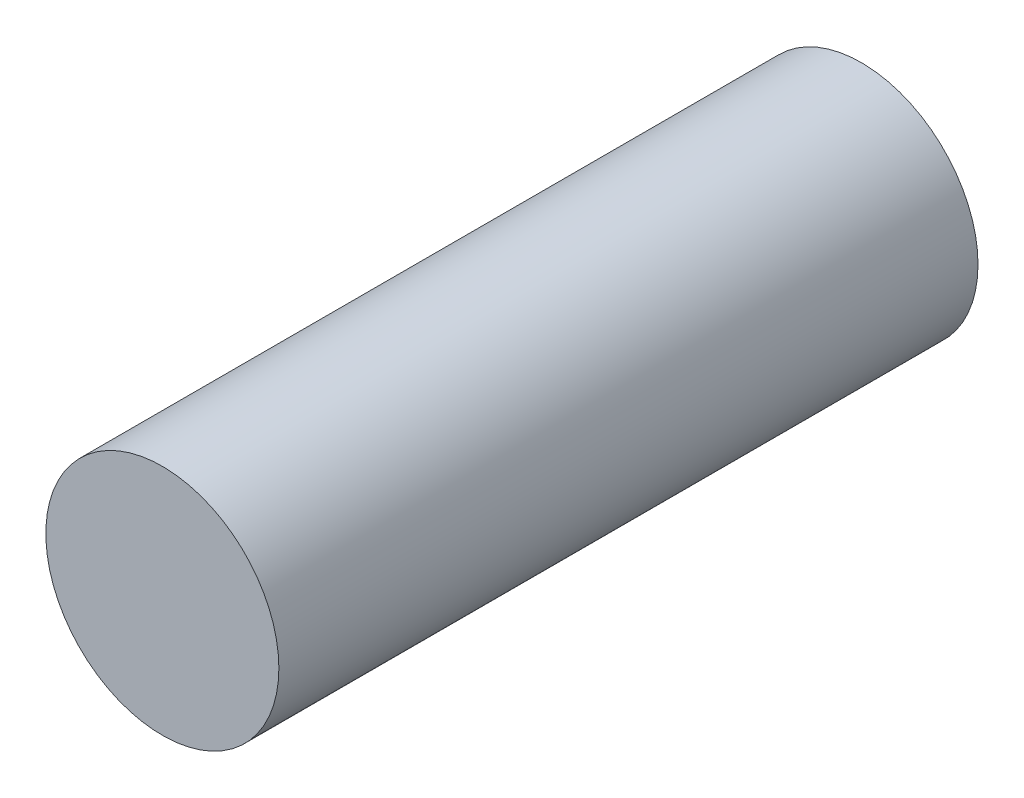
ISO-10303-21;
HEADER;
FILE_DESCRIPTION(('STEP AP214'),'2;1');
FILE_NAME('part.step','',(''),(''),'','','');
FILE_SCHEMA(('AUTOMOTIVE_DESIGN { 1 0 10303 214 1 1 1 1 }'));
ENDSEC;
DATA;
#1=APPLICATION_CONTEXT('core data for automotive mechanical design processes');
#2=APPLICATION_PROTOCOL_DEFINITION('international standard','automotive_design',2000,#1);
#3=PRODUCT_CONTEXT('',#1,'mechanical');
#4=PRODUCT('Part','Part','',(#3));
#5=PRODUCT_RELATED_PRODUCT_CATEGORY('part','',(#4));
#6=PRODUCT_DEFINITION_FORMATION('','',#4);
#7=PRODUCT_DEFINITION_CONTEXT('part definition',#1,'design');
#8=PRODUCT_DEFINITION('design','',#6,#7);
#9=PRODUCT_DEFINITION_SHAPE('','',#8);
#10=(LENGTH_UNIT() NAMED_UNIT(*) SI_UNIT(.MILLI.,.METRE.));
#11=(NAMED_UNIT(*) PLANE_ANGLE_UNIT() SI_UNIT($,.RADIAN.));
#12=(NAMED_UNIT(*) SI_UNIT($,.STERADIAN.) SOLID_ANGLE_UNIT());
#13=UNCERTAINTY_MEASURE_WITH_UNIT(LENGTH_MEASURE(1.E-05),#10,'distance_accuracy_value','');
#14=(GEOMETRIC_REPRESENTATION_CONTEXT(3) GLOBAL_UNCERTAINTY_ASSIGNED_CONTEXT((#13)) GLOBAL_UNIT_ASSIGNED_CONTEXT((#10,
#11,#12)) REPRESENTATION_CONTEXT('',''));
#15=CARTESIAN_POINT('',(0.,0.,0.));
#16=DIRECTION('',(0.,0.,1.));
#17=DIRECTION('',(1.,0.,0.));
#18=AXIS2_PLACEMENT_3D('',#15,#16,#17);
#19=CARTESIAN_POINT('',(0.,0.,3.));
#20=DIRECTION('',(0.,0.,-1.));
#21=DIRECTION('',(-1.,0.,0.));
#22=AXIS2_PLACEMENT_3D('',#19,#20,#21);
#23=CYLINDRICAL_SURFACE('',#22,0.5);
#24=CARTESIAN_POINT('',(0.,0.,3.));
#25=DIRECTION('',(0.,0.,1.));
#26=DIRECTION('',(1.,0.,0.));
#27=AXIS2_PLACEMENT_3D('',#24,#25,#26);
#28=CIRCLE('',#27,0.5);
#29=CARTESIAN_POINT('',(0.5,0.,3.));
#30=VERTEX_POINT('',#29);
#31=EDGE_CURVE('E10',#30,#30,#28,.T.);
#32=ORIENTED_EDGE('',*,*,#31,.F.);
#33=EDGE_LOOP('',(#32));
#34=FACE_BOUND('',#33,.T.);
#35=CARTESIAN_POINT('',(0.,0.,0.));
#36=DIRECTION('',(0.,0.,1.));
#37=DIRECTION('',(1.,0.,0.));
#38=AXIS2_PLACEMENT_3D('',#35,#36,#37);
#39=CIRCLE('',#38,0.5);
#40=CARTESIAN_POINT('',(0.5,0.,0.));
#41=VERTEX_POINT('',#40);
#42=EDGE_CURVE('E37',#41,#41,#39,.T.);
#43=ORIENTED_EDGE('',*,*,#42,.T.);
#44=EDGE_LOOP('',(#43));
#45=FACE_BOUND('',#44,.T.);
#46=ADVANCED_FACE('F34',(#34,#45),#23,.T.);
#47=CARTESIAN_POINT('',(0.,0.,3.));
#48=DIRECTION('',(0.,0.,1.));
#49=DIRECTION('',(1.,0.,0.));
#50=AXIS2_PLACEMENT_3D('',#47,#48,#49);
#51=PLANE('',#50);
#52=ORIENTED_EDGE('',*,*,#31,.T.);
#53=EDGE_LOOP('',(#52));
#54=FACE_BOUND('',#53,.T.);
#55=ADVANCED_FACE('F49',(#54),#51,.T.);
#56=CARTESIAN_POINT('',(0.,0.,0.));
#57=DIRECTION('',(0.,0.,1.));
#58=DIRECTION('',(1.,0.,0.));
#59=AXIS2_PLACEMENT_3D('',#56,#57,#58);
#60=PLANE('',#59);
#61=ORIENTED_EDGE('',*,*,#42,.F.);
#62=EDGE_LOOP('',(#61));
#63=FACE_BOUND('',#62,.T.);
#64=ADVANCED_FACE('F47',(#63),#60,.F.);
#65=CLOSED_SHELL('',(#46,#55,#64));
#66=MANIFOLD_SOLID_BREP('B2',#65);
#67=ADVANCED_BREP_SHAPE_REPRESENTATION('',(#18,#66),#14);
#68=SHAPE_DEFINITION_REPRESENTATION(#9,#67);
ENDSEC;
END-ISO-10303-21;
